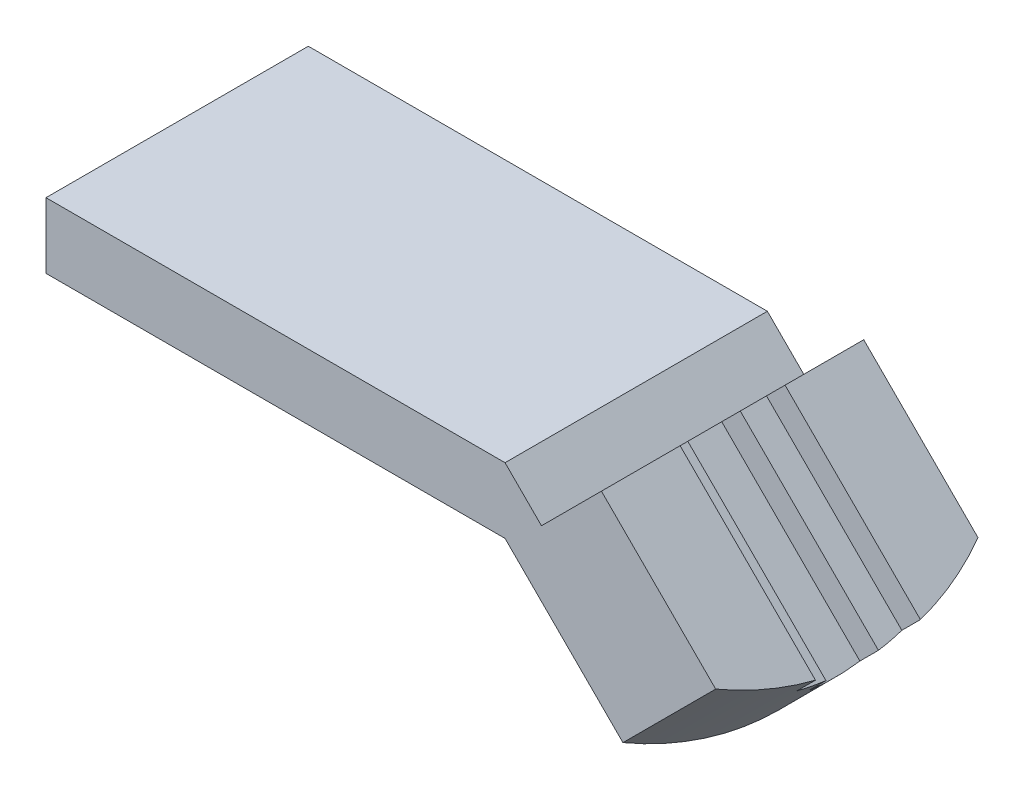
ISO-10303-21;
HEADER;
FILE_DESCRIPTION(('STEP AP214'),'2;1');
FILE_NAME('part.step','',(''),(''),'','','');
FILE_SCHEMA(('AUTOMOTIVE_DESIGN { 1 0 10303 214 1 1 1 1 }'));
ENDSEC;
DATA;
#1=APPLICATION_CONTEXT('core data for automotive mechanical design processes');
#2=APPLICATION_PROTOCOL_DEFINITION('international standard','automotive_design',2000,#1);
#3=PRODUCT_CONTEXT('',#1,'mechanical');
#4=PRODUCT('Part','Part','',(#3));
#5=PRODUCT_RELATED_PRODUCT_CATEGORY('part','',(#4));
#6=PRODUCT_DEFINITION_FORMATION('','',#4);
#7=PRODUCT_DEFINITION_CONTEXT('part definition',#1,'design');
#8=PRODUCT_DEFINITION('design','',#6,#7);
#9=PRODUCT_DEFINITION_SHAPE('','',#8);
#10=(LENGTH_UNIT() NAMED_UNIT(*) SI_UNIT(.MILLI.,.METRE.));
#11=(NAMED_UNIT(*) PLANE_ANGLE_UNIT() SI_UNIT($,.RADIAN.));
#12=(NAMED_UNIT(*) SI_UNIT($,.STERADIAN.) SOLID_ANGLE_UNIT());
#13=UNCERTAINTY_MEASURE_WITH_UNIT(LENGTH_MEASURE(1.E-05),#10,'distance_accuracy_value','');
#14=(GEOMETRIC_REPRESENTATION_CONTEXT(3) GLOBAL_UNCERTAINTY_ASSIGNED_CONTEXT((#13)) GLOBAL_UNIT_ASSIGNED_CONTEXT((#10,
#11,#12)) REPRESENTATION_CONTEXT('',''));
#15=CARTESIAN_POINT('',(0.,0.,0.));
#16=DIRECTION('',(0.,0.,1.));
#17=DIRECTION('',(1.,0.,0.));
#18=AXIS2_PLACEMENT_3D('',#15,#16,#17);
#19=CARTESIAN_POINT('',(52.9540920986001,-3.81195647486901,20.));
#20=DIRECTION('',(-0.70710678118654,-0.707106781186555,0.));
#21=DIRECTION('',(0.707106781186555,-0.70710678118654,0.));
#22=AXIS2_PLACEMENT_3D('',#19,#20,#21);
#23=PLANE('',#22);
#24=DIRECTION('',(-0.707106781186551,0.707106781186544,0.));
#25=VECTOR('',#24,1.);
#26=CARTESIAN_POINT('',(140.848249718156,-91.7061140944243,6.));
#27=LINE('',#26,#25);
#28=CARTESIAN_POINT('',(52.6683629354202,-3.52622731168906,5.99999999999998));
#29=VERTEX_POINT('',#28);
#30=CARTESIAN_POINT('',(42.3474903808018,6.79464524292908,6.));
#31=VERTEX_POINT('',#30);
#32=EDGE_CURVE('E168',#29,#31,#27,.T.);
#33=ORIENTED_EDGE('',*,*,#32,.F.);
#34=CARTESIAN_POINT('',(38.811956474869,10.3301791488618,10.));
#35=DIRECTION('',(-0.70710678118654,-0.707106781186555,0.));
#36=DIRECTION('',(0.707106781186555,-0.70710678118654,0.));
#37=AXIS2_PLACEMENT_3D('',#34,#35,#36);
#38=CIRCLE('',#37,20.);
#39=CARTESIAN_POINT('',(51.059405188785,-1.91726956505396,0.));
#40=VERTEX_POINT('',#39);
#41=EDGE_CURVE('E184',#29,#40,#38,.F.);
#42=ORIENTED_EDGE('',*,*,#41,.T.);
#43=DIRECTION('',(-0.707106781186555,0.70710678118654,0.));
#44=VECTOR('',#43,1.);
#45=CARTESIAN_POINT('',(52.9540920986001,-3.81195647486901,0.));
#46=LINE('',#45,#44);
#47=CARTESIAN_POINT('',(42.3474903808018,6.79464524292908,0.));
#48=VERTEX_POINT('',#47);
#49=EDGE_CURVE('E264',#40,#48,#46,.T.);
#50=ORIENTED_EDGE('',*,*,#49,.T.);
#51=DIRECTION('',(0.,0.,-1.));
#52=VECTOR('',#51,1.);
#53=CARTESIAN_POINT('',(42.3474903808018,6.79464524292908,20.));
#54=LINE('',#53,#52);
#55=EDGE_CURVE('E286',#31,#48,#54,.T.);
#56=ORIENTED_EDGE('',*,*,#55,.F.);
#57=EDGE_LOOP('',(#33,#42,#50,#56));
#58=FACE_BOUND('',#57,.T.);
#59=ADVANCED_FACE('F43',(#58),#23,.F.);
#60=CARTESIAN_POINT('',(35.,0.,20.));
#61=DIRECTION('',(0.707106781186544,0.707106781186551,0.));
#62=DIRECTION('',(-0.707106781186551,0.707106781186544,0.));
#63=AXIS2_PLACEMENT_3D('',#60,#61,#62);
#64=PLANE('',#63);
#65=DIRECTION('',(0.707106781186551,-0.707106781186544,0.));
#66=VECTOR('',#65,1.);
#67=CARTESIAN_POINT('',(35.,0.,0.));
#68=LINE('',#67,#66);
#69=CARTESIAN_POINT('',(35.,0.,0.));
#70=VERTEX_POINT('',#69);
#71=CARTESIAN_POINT('',(43.9883373769196,-8.9883373769195,0.));
#72=VERTEX_POINT('',#71);
#73=EDGE_CURVE('E261',#70,#72,#68,.T.);
#74=ORIENTED_EDGE('',*,*,#73,.T.);
#75=CARTESIAN_POINT('',(31.7408886630036,3.25911133699631,10.));
#76=DIRECTION('',(0.707106781186544,0.707106781186551,0.));
#77=DIRECTION('',(-0.707106781186551,0.707106781186544,0.));
#78=AXIS2_PLACEMENT_3D('',#75,#76,#77);
#79=CIRCLE('',#78,20.);
#80=CARTESIAN_POINT('',(43.9883373769196,-8.9883373769195,20.));
#81=VERTEX_POINT('',#80);
#82=EDGE_CURVE('E67',#72,#81,#79,.F.);
#83=ORIENTED_EDGE('',*,*,#82,.T.);
#84=DIRECTION('',(0.707106781186551,-0.707106781186544,0.));
#85=VECTOR('',#84,1.);
#86=CARTESIAN_POINT('',(35.,0.,20.));
#87=LINE('',#86,#85);
#88=CARTESIAN_POINT('',(35.,0.,20.));
#89=VERTEX_POINT('',#88);
#90=EDGE_CURVE('E239',#89,#81,#87,.T.);
#91=ORIENTED_EDGE('',*,*,#90,.F.);
#92=DIRECTION('',(0.,0.,-1.));
#93=VECTOR('',#92,1.);
#94=CARTESIAN_POINT('',(35.,0.,20.));
#95=LINE('',#94,#93);
#96=EDGE_CURVE('E291',#89,#70,#95,.T.);
#97=ORIENTED_EDGE('',*,*,#96,.T.);
#98=EDGE_LOOP('',(#74,#83,#91,#97));
#99=FACE_BOUND('',#98,.T.);
#100=ADVANCED_FACE('F372',(#99),#64,.F.);
#101=DIRECTION('',(-0.707106781186555,0.70710678118654,0.));
#102=VECTOR('',#101,1.);
#103=CARTESIAN_POINT('',(52.9540920986001,-3.81195647486901,20.));
#104=LINE('',#103,#102);
#105=CARTESIAN_POINT('',(51.059405188785,-1.91726956505396,20.));
#106=VERTEX_POINT('',#105);
#107=CARTESIAN_POINT('',(42.3474903808018,6.79464524292908,20.));
#108=VERTEX_POINT('',#107);
#109=EDGE_CURVE('E242',#106,#108,#104,.T.);
#110=ORIENTED_EDGE('',*,*,#109,.F.);
#111=CARTESIAN_POINT('',(38.811956474869,10.3301791488618,10.));
#112=DIRECTION('',(-0.70710678118654,-0.707106781186555,0.));
#113=DIRECTION('',(0.707106781186555,-0.70710678118654,0.));
#114=AXIS2_PLACEMENT_3D('',#111,#112,#113);
#115=CIRCLE('',#114,20.);
#116=CARTESIAN_POINT('',(52.6683629354201,-3.52622731168906,14.));
#117=VERTEX_POINT('',#116);
#118=EDGE_CURVE('E200',#106,#117,#115,.F.);
#119=ORIENTED_EDGE('',*,*,#118,.T.);
#120=DIRECTION('',(-0.707106781186551,0.707106781186544,0.));
#121=VECTOR('',#120,1.);
#122=CARTESIAN_POINT('',(140.848249718156,-91.7061140944243,14.));
#123=LINE('',#122,#121);
#124=CARTESIAN_POINT('',(42.3474903808018,6.79464524292908,14.));
#125=VERTEX_POINT('',#124);
#126=EDGE_CURVE('E227',#117,#125,#123,.T.);
#127=ORIENTED_EDGE('',*,*,#126,.T.);
#128=EDGE_CURVE('E287',#108,#125,#54,.T.);
#129=ORIENTED_EDGE('',*,*,#128,.F.);
#130=EDGE_LOOP('',(#110,#119,#127,#129));
#131=FACE_BOUND('',#130,.T.);
#132=ADVANCED_FACE('F365',(#131),#23,.F.);
#133=CARTESIAN_POINT('',(0.,0.,20.));
#134=DIRECTION('',(0.,0.,-1.));
#135=DIRECTION('',(-1.,0.,0.));
#136=AXIS2_PLACEMENT_3D('',#133,#134,#135);
#137=PLANE('',#136);
#138=DIRECTION('',(-0.70710678118654,-0.707106781186555,0.));
#139=VECTOR('',#138,1.);
#140=CARTESIAN_POINT('',(103.474782449922,50.498107696084,20.));
#141=LINE('',#140,#139);
#142=EDGE_CURVE('E59',#106,#81,#141,.T.);
#143=ORIENTED_EDGE('',*,*,#142,.F.);
#144=ORIENTED_EDGE('',*,*,#109,.T.);
#145=DIRECTION('',(-0.707106781186544,-0.707106781186552,0.));
#146=VECTOR('',#145,1.);
#147=CARTESIAN_POINT('',(42.3474903808018,6.79464524292908,20.));
#148=LINE('',#147,#146);
#149=CARTESIAN_POINT('',(37.7764225689363,2.22357743106358,20.));
#150=VERTEX_POINT('',#149);
#151=EDGE_CURVE('E245',#108,#150,#148,.T.);
#152=ORIENTED_EDGE('',*,*,#151,.T.);
#153=DIRECTION('',(-0.707106781186536,0.707106781186559,0.));
#154=VECTOR('',#153,1.);
#155=CARTESIAN_POINT('',(37.7764225689363,2.22357743106358,20.));
#156=LINE('',#155,#154);
#157=CARTESIAN_POINT('',(35.,5.,20.));
#158=VERTEX_POINT('',#157);
#159=EDGE_CURVE('E248',#150,#158,#156,.T.);
#160=ORIENTED_EDGE('',*,*,#159,.T.);
#161=DIRECTION('',(-1.,0.,0.));
#162=VECTOR('',#161,1.);
#163=CARTESIAN_POINT('',(0.,5.,20.));
#164=LINE('',#163,#162);
#165=CARTESIAN_POINT('',(0.,5.,20.));
#166=VERTEX_POINT('',#165);
#167=EDGE_CURVE('E251',#158,#166,#164,.T.);
#168=ORIENTED_EDGE('',*,*,#167,.T.);
#169=DIRECTION('',(0.,-1.,0.));
#170=VECTOR('',#169,1.);
#171=CARTESIAN_POINT('',(0.,0.,20.));
#172=LINE('',#171,#170);
#173=CARTESIAN_POINT('',(0.,0.,20.));
#174=VERTEX_POINT('',#173);
#175=EDGE_CURVE('E231',#166,#174,#172,.T.);
#176=ORIENTED_EDGE('',*,*,#175,.T.);
#177=DIRECTION('',(1.,0.,0.));
#178=VECTOR('',#177,1.);
#179=CARTESIAN_POINT('',(0.,0.,20.));
#180=LINE('',#179,#178);
#181=EDGE_CURVE('E235',#174,#89,#180,.T.);
#182=ORIENTED_EDGE('',*,*,#181,.T.);
#183=ORIENTED_EDGE('',*,*,#90,.T.);
#184=EDGE_LOOP('',(#143,#144,#152,#160,#168,#176,#182,#183));
#185=FACE_BOUND('',#184,.T.);
#186=ADVANCED_FACE('F361',(#185),#137,.F.);
#187=CARTESIAN_POINT('',(0.,0.,0.));
#188=DIRECTION('',(0.,0.,-1.));
#189=DIRECTION('',(-1.,0.,0.));
#190=AXIS2_PLACEMENT_3D('',#187,#188,#189);
#191=PLANE('',#190);
#192=ORIENTED_EDGE('',*,*,#49,.F.);
#193=DIRECTION('',(-0.70710678118654,-0.707106781186555,0.));
#194=VECTOR('',#193,1.);
#195=CARTESIAN_POINT('',(103.474782449922,50.498107696084,0.));
#196=LINE('',#195,#194);
#197=EDGE_CURVE('E179',#40,#72,#196,.T.);
#198=ORIENTED_EDGE('',*,*,#197,.T.);
#199=ORIENTED_EDGE('',*,*,#73,.F.);
#200=DIRECTION('',(1.,0.,0.));
#201=VECTOR('',#200,1.);
#202=CARTESIAN_POINT('',(0.,0.,0.));
#203=LINE('',#202,#201);
#204=CARTESIAN_POINT('',(0.,0.,0.));
#205=VERTEX_POINT('',#204);
#206=EDGE_CURVE('E258',#205,#70,#203,.T.);
#207=ORIENTED_EDGE('',*,*,#206,.F.);
#208=DIRECTION('',(0.,-1.,0.));
#209=VECTOR('',#208,1.);
#210=CARTESIAN_POINT('',(0.,0.,0.));
#211=LINE('',#210,#209);
#212=CARTESIAN_POINT('',(0.,5.,0.));
#213=VERTEX_POINT('',#212);
#214=EDGE_CURVE('E230',#213,#205,#211,.T.);
#215=ORIENTED_EDGE('',*,*,#214,.F.);
#216=DIRECTION('',(-1.,0.,0.));
#217=VECTOR('',#216,1.);
#218=CARTESIAN_POINT('',(0.,5.,0.));
#219=LINE('',#218,#217);
#220=CARTESIAN_POINT('',(35.,5.,0.));
#221=VERTEX_POINT('',#220);
#222=EDGE_CURVE('E236',#221,#213,#219,.T.);
#223=ORIENTED_EDGE('',*,*,#222,.F.);
#224=DIRECTION('',(-0.707106781186536,0.707106781186559,0.));
#225=VECTOR('',#224,1.);
#226=CARTESIAN_POINT('',(37.7764225689363,2.22357743106358,0.));
#227=LINE('',#226,#225);
#228=CARTESIAN_POINT('',(37.7764225689363,2.22357743106358,0.));
#229=VERTEX_POINT('',#228);
#230=EDGE_CURVE('E270',#229,#221,#227,.T.);
#231=ORIENTED_EDGE('',*,*,#230,.F.);
#232=DIRECTION('',(-0.707106781186544,-0.707106781186552,0.));
#233=VECTOR('',#232,1.);
#234=CARTESIAN_POINT('',(42.3474903808018,6.79464524292908,0.));
#235=LINE('',#234,#233);
#236=EDGE_CURVE('E267',#48,#229,#235,.T.);
#237=ORIENTED_EDGE('',*,*,#236,.F.);
#238=EDGE_LOOP('',(#192,#198,#199,#207,#215,#223,#231,#237));
#239=FACE_BOUND('',#238,.T.);
#240=ADVANCED_FACE('F351',(#239),#191,.T.);
#241=CARTESIAN_POINT('',(139.434036155783,-93.1203276567974,14.));
#242=DIRECTION('',(0.707106781186544,0.707106781186551,0.));
#243=DIRECTION('',(-0.707106781186551,0.707106781186544,0.));
#244=AXIS2_PLACEMENT_3D('',#241,#242,#243);
#245=PLANE('',#244);
#246=CARTESIAN_POINT('',(37.397742912496,8.91596558648877,10.));
#247=DIRECTION('',(0.707106781186544,0.707106781186551,0.));
#248=DIRECTION('',(-0.707106781186551,0.707106781186544,0.));
#249=AXIS2_PLACEMENT_3D('',#246,#247,#248);
#250=CIRCLE('',#249,20.);
#251=CARTESIAN_POINT('',(51.4689901919663,-5.15528169298147,12.));
#252=VERTEX_POINT('',#251);
#253=CARTESIAN_POINT('',(51.2541493730471,-4.94044087406217,14.));
#254=VERTEX_POINT('',#253);
#255=EDGE_CURVE('E194',#252,#254,#250,.F.);
#256=ORIENTED_EDGE('',*,*,#255,.F.);
#257=DIRECTION('',(-0.707106781186551,0.707106781186544,0.));
#258=VECTOR('',#257,1.);
#259=CARTESIAN_POINT('',(139.434036155783,-93.1203276567974,12.));
#260=LINE('',#259,#258);
#261=CARTESIAN_POINT('',(40.9332768184287,5.38043168055604,12.));
#262=VERTEX_POINT('',#261);
#263=EDGE_CURVE('E221',#252,#262,#260,.T.);
#264=ORIENTED_EDGE('',*,*,#263,.T.);
#265=DIRECTION('',(0.,0.,1.));
#266=VECTOR('',#265,1.);
#267=CARTESIAN_POINT('',(40.9332768184287,5.38043168055604,20.));
#268=LINE('',#267,#266);
#269=CARTESIAN_POINT('',(40.9332768184287,5.38043168055604,14.));
#270=VERTEX_POINT('',#269);
#271=EDGE_CURVE('E316',#262,#270,#268,.T.);
#272=ORIENTED_EDGE('',*,*,#271,.T.);
#273=DIRECTION('',(-0.707106781186551,0.707106781186544,0.));
#274=VECTOR('',#273,1.);
#275=CARTESIAN_POINT('',(139.434036155783,-93.1203276567974,14.));
#276=LINE('',#275,#274);
#277=EDGE_CURVE('E224',#254,#270,#276,.T.);
#278=ORIENTED_EDGE('',*,*,#277,.F.);
#279=EDGE_LOOP('',(#256,#264,#272,#278));
#280=FACE_BOUND('',#279,.T.);
#281=ADVANCED_FACE('F333',(#280),#245,.T.);
#282=CARTESIAN_POINT('',(138.01982259341,-94.5345412191705,12.));
#283=DIRECTION('',(0.707106781186544,0.707106781186551,0.));
#284=DIRECTION('',(-0.707106781186551,0.707106781186544,0.));
#285=AXIS2_PLACEMENT_3D('',#282,#283,#284);
#286=PLANE('',#285);
#287=CARTESIAN_POINT('',(35.9835293501229,7.50175202411565,10.));
#288=DIRECTION('',(0.707106781186544,0.707106781186551,0.));
#289=DIRECTION('',(-0.707106781186551,0.707106781186544,0.));
#290=AXIS2_PLACEMENT_3D('',#287,#288,#289);
#291=CIRCLE('',#290,20.);
#292=CARTESIAN_POINT('',(50.0547766295933,-6.56949525535458,8.));
#293=VERTEX_POINT('',#292);
#294=CARTESIAN_POINT('',(50.0547766295932,-6.56949525535455,12.));
#295=VERTEX_POINT('',#294);
#296=EDGE_CURVE('E189',#293,#295,#291,.F.);
#297=ORIENTED_EDGE('',*,*,#296,.F.);
#298=DIRECTION('',(-0.707106781186551,0.707106781186544,0.));
#299=VECTOR('',#298,1.);
#300=CARTESIAN_POINT('',(138.01982259341,-94.5345412191705,8.));
#301=LINE('',#300,#299);
#302=CARTESIAN_POINT('',(39.5190632560557,3.96621811818294,8.));
#303=VERTEX_POINT('',#302);
#304=EDGE_CURVE('E215',#293,#303,#301,.T.);
#305=ORIENTED_EDGE('',*,*,#304,.T.);
#306=DIRECTION('',(0.,0.,1.));
#307=VECTOR('',#306,1.);
#308=CARTESIAN_POINT('',(39.5190632560557,3.96621811818293,20.));
#309=LINE('',#308,#307);
#310=CARTESIAN_POINT('',(39.5190632560557,3.96621811818293,12.));
#311=VERTEX_POINT('',#310);
#312=EDGE_CURVE('E308',#303,#311,#309,.T.);
#313=ORIENTED_EDGE('',*,*,#312,.T.);
#314=DIRECTION('',(-0.707106781186551,0.707106781186544,0.));
#315=VECTOR('',#314,1.);
#316=CARTESIAN_POINT('',(138.01982259341,-94.5345412191705,12.));
#317=LINE('',#316,#315);
#318=EDGE_CURVE('E218',#295,#311,#317,.T.);
#319=ORIENTED_EDGE('',*,*,#318,.F.);
#320=EDGE_LOOP('',(#297,#305,#313,#319));
#321=FACE_BOUND('',#320,.T.);
#322=ADVANCED_FACE('F341',(#321),#286,.T.);
#323=CARTESIAN_POINT('',(139.434036155783,-93.1203276567974,8.));
#324=DIRECTION('',(0.707106781186544,0.707106781186551,0.));
#325=DIRECTION('',(-0.707106781186551,0.707106781186544,0.));
#326=AXIS2_PLACEMENT_3D('',#323,#324,#325);
#327=PLANE('',#326);
#328=CARTESIAN_POINT('',(37.397742912496,8.91596558648877,10.));
#329=DIRECTION('',(0.707106781186544,0.707106781186551,0.));
#330=DIRECTION('',(-0.707106781186551,0.707106781186544,0.));
#331=AXIS2_PLACEMENT_3D('',#328,#329,#330);
#332=CIRCLE('',#331,20.);
#333=CARTESIAN_POINT('',(51.2541493730471,-4.94044087406219,5.99999999999998));
#334=VERTEX_POINT('',#333);
#335=CARTESIAN_POINT('',(51.4689901919663,-5.15528169298144,8.));
#336=VERTEX_POINT('',#335);
#337=EDGE_CURVE('E172',#334,#336,#332,.F.);
#338=ORIENTED_EDGE('',*,*,#337,.F.);
#339=DIRECTION('',(-0.707106781186551,0.707106781186544,0.));
#340=VECTOR('',#339,1.);
#341=CARTESIAN_POINT('',(139.434036155783,-93.1203276567974,6.));
#342=LINE('',#341,#340);
#343=CARTESIAN_POINT('',(40.9332768184287,5.38043168055604,6.));
#344=VERTEX_POINT('',#343);
#345=EDGE_CURVE('E158',#334,#344,#342,.T.);
#346=ORIENTED_EDGE('',*,*,#345,.T.);
#347=DIRECTION('',(0.,0.,1.));
#348=VECTOR('',#347,1.);
#349=CARTESIAN_POINT('',(40.9332768184287,5.38043168055604,20.));
#350=LINE('',#349,#348);
#351=CARTESIAN_POINT('',(40.9332768184287,5.38043168055604,8.));
#352=VERTEX_POINT('',#351);
#353=EDGE_CURVE('E301',#344,#352,#350,.T.);
#354=ORIENTED_EDGE('',*,*,#353,.T.);
#355=DIRECTION('',(-0.707106781186551,0.707106781186544,0.));
#356=VECTOR('',#355,1.);
#357=CARTESIAN_POINT('',(139.434036155783,-93.1203276567974,8.));
#358=LINE('',#357,#356);
#359=EDGE_CURVE('E174',#336,#352,#358,.T.);
#360=ORIENTED_EDGE('',*,*,#359,.F.);
#361=EDGE_LOOP('',(#338,#346,#354,#360));
#362=FACE_BOUND('',#361,.T.);
#363=ADVANCED_FACE('F173',(#362),#327,.T.);
#364=CARTESIAN_POINT('',(42.3474903808018,6.79464524292908,20.));
#365=DIRECTION('',(0.707106781186552,-0.707106781186544,0.));
#366=DIRECTION('',(0.707106781186544,0.707106781186551,0.));
#367=AXIS2_PLACEMENT_3D('',#364,#365,#366);
#368=PLANE('',#367);
#369=DIRECTION('',(0.707106781186544,0.707106781186551,0.));
#370=VECTOR('',#369,1.);
#371=CARTESIAN_POINT('',(42.3474903808018,6.79464524292908,14.));
#372=LINE('',#371,#370);
#373=EDGE_CURVE('E52',#270,#125,#372,.T.);
#374=ORIENTED_EDGE('',*,*,#373,.F.);
#375=ORIENTED_EDGE('',*,*,#271,.F.);
#376=DIRECTION('',(0.707106781186544,0.707106781186551,0.));
#377=VECTOR('',#376,1.);
#378=CARTESIAN_POINT('',(42.3474903808018,6.79464524292908,12.));
#379=LINE('',#378,#377);
#380=EDGE_CURVE('E312',#311,#262,#379,.T.);
#381=ORIENTED_EDGE('',*,*,#380,.F.);
#382=ORIENTED_EDGE('',*,*,#312,.F.);
#383=DIRECTION('',(-0.707106781186544,-0.707106781186551,0.));
#384=VECTOR('',#383,1.);
#385=CARTESIAN_POINT('',(42.3474903808018,6.79464524292908,8.));
#386=LINE('',#385,#384);
#387=EDGE_CURVE('E304',#352,#303,#386,.T.);
#388=ORIENTED_EDGE('',*,*,#387,.F.);
#389=ORIENTED_EDGE('',*,*,#353,.F.);
#390=DIRECTION('',(-0.707106781186544,-0.707106781186551,0.));
#391=VECTOR('',#390,1.);
#392=CARTESIAN_POINT('',(42.3474903808018,6.79464524292907,6.));
#393=LINE('',#392,#391);
#394=EDGE_CURVE('E163',#31,#344,#393,.T.);
#395=ORIENTED_EDGE('',*,*,#394,.F.);
#396=ORIENTED_EDGE('',*,*,#55,.T.);
#397=ORIENTED_EDGE('',*,*,#236,.T.);
#398=DIRECTION('',(0.,0.,-1.));
#399=VECTOR('',#398,1.);
#400=CARTESIAN_POINT('',(37.7764225689363,2.22357743106358,20.));
#401=LINE('',#400,#399);
#402=EDGE_CURVE('E282',#150,#229,#401,.T.);
#403=ORIENTED_EDGE('',*,*,#402,.F.);
#404=ORIENTED_EDGE('',*,*,#151,.F.);
#405=ORIENTED_EDGE('',*,*,#128,.T.);
#406=EDGE_LOOP('',(#374,#375,#381,#382,#388,#389,#395,#396,#397,#403,#404,#405));
#407=FACE_BOUND('',#406,.T.);
#408=ADVANCED_FACE('F328',(#407),#368,.F.);
#409=CARTESIAN_POINT('',(0.,0.,20.));
#410=DIRECTION('',(1.,0.,0.));
#411=DIRECTION('',(0.,0.,-1.));
#412=AXIS2_PLACEMENT_3D('',#409,#410,#411);
#413=PLANE('',#412);
#414=ORIENTED_EDGE('',*,*,#214,.T.);
#415=DIRECTION('',(0.,0.,-1.));
#416=VECTOR('',#415,1.);
#417=CARTESIAN_POINT('',(0.,0.,20.));
#418=LINE('',#417,#416);
#419=EDGE_CURVE('E295',#174,#205,#418,.T.);
#420=ORIENTED_EDGE('',*,*,#419,.F.);
#421=ORIENTED_EDGE('',*,*,#175,.F.);
#422=DIRECTION('',(0.,0.,-1.));
#423=VECTOR('',#422,1.);
#424=CARTESIAN_POINT('',(0.,5.,20.));
#425=LINE('',#424,#423);
#426=EDGE_CURVE('E254',#166,#213,#425,.T.);
#427=ORIENTED_EDGE('',*,*,#426,.T.);
#428=EDGE_LOOP('',(#414,#420,#421,#427));
#429=FACE_BOUND('',#428,.T.);
#430=ADVANCED_FACE('F45',(#429),#413,.F.);
#431=CARTESIAN_POINT('',(0.,0.,20.));
#432=DIRECTION('',(0.,1.,0.));
#433=DIRECTION('',(0.,0.,1.));
#434=AXIS2_PLACEMENT_3D('',#431,#432,#433);
#435=PLANE('',#434);
#436=ORIENTED_EDGE('',*,*,#206,.T.);
#437=ORIENTED_EDGE('',*,*,#96,.F.);
#438=ORIENTED_EDGE('',*,*,#181,.F.);
#439=ORIENTED_EDGE('',*,*,#419,.T.);
#440=EDGE_LOOP('',(#436,#437,#438,#439));
#441=FACE_BOUND('',#440,.T.);
#442=ADVANCED_FACE('F496',(#441),#435,.F.);
#443=CARTESIAN_POINT('',(37.7764225689363,2.22357743106358,20.));
#444=DIRECTION('',(-0.707106781186559,-0.707106781186536,0.));
#445=DIRECTION('',(0.707106781186536,-0.707106781186559,0.));
#446=AXIS2_PLACEMENT_3D('',#443,#444,#445);
#447=PLANE('',#446);
#448=ORIENTED_EDGE('',*,*,#230,.T.);
#449=DIRECTION('',(0.,0.,-1.));
#450=VECTOR('',#449,1.);
#451=CARTESIAN_POINT('',(35.,5.,20.));
#452=LINE('',#451,#450);
#453=EDGE_CURVE('E278',#158,#221,#452,.T.);
#454=ORIENTED_EDGE('',*,*,#453,.F.);
#455=ORIENTED_EDGE('',*,*,#159,.F.);
#456=ORIENTED_EDGE('',*,*,#402,.T.);
#457=EDGE_LOOP('',(#448,#454,#455,#456));
#458=FACE_BOUND('',#457,.T.);
#459=ADVANCED_FACE('F358',(#458),#447,.F.);
#460=CARTESIAN_POINT('',(0.,5.,20.));
#461=DIRECTION('',(0.,-1.,0.));
#462=DIRECTION('',(0.,0.,-1.));
#463=AXIS2_PLACEMENT_3D('',#460,#461,#462);
#464=PLANE('',#463);
#465=ORIENTED_EDGE('',*,*,#222,.T.);
#466=ORIENTED_EDGE('',*,*,#426,.F.);
#467=ORIENTED_EDGE('',*,*,#167,.F.);
#468=ORIENTED_EDGE('',*,*,#453,.T.);
#469=EDGE_LOOP('',(#465,#466,#467,#468));
#470=FACE_BOUND('',#469,.T.);
#471=ADVANCED_FACE('F444',(#470),#464,.F.);
#472=CARTESIAN_POINT('',(140.848249718156,-91.7061140944243,14.));
#473=DIRECTION('',(0.,0.,-1.));
#474=DIRECTION('',(0.,1.,0.));
#475=AXIS2_PLACEMENT_3D('',#472,#473,#474);
#476=PLANE('',#475);
#477=DIRECTION('',(-0.70710678118654,-0.707106781186555,0.));
#478=VECTOR('',#477,1.);
#479=CARTESIAN_POINT('',(105.083740196557,48.8891499494489,14.0000000000001));
#480=LINE('',#479,#478);
#481=EDGE_CURVE('E205',#254,#117,#480,.F.);
#482=ORIENTED_EDGE('',*,*,#481,.F.);
#483=ORIENTED_EDGE('',*,*,#277,.T.);
#484=ORIENTED_EDGE('',*,*,#373,.T.);
#485=ORIENTED_EDGE('',*,*,#126,.F.);
#486=EDGE_LOOP('',(#482,#483,#484,#485));
#487=FACE_BOUND('',#486,.T.);
#488=ADVANCED_FACE('F324',(#487),#476,.T.);
#489=CARTESIAN_POINT('',(139.434036155783,-93.1203276567974,12.));
#490=DIRECTION('',(0.,0.,-1.));
#491=DIRECTION('',(-1.,0.,0.));
#492=AXIS2_PLACEMENT_3D('',#489,#490,#491);
#493=PLANE('',#492);
#494=DIRECTION('',(-0.70710678118654,-0.707106781186555,0.));
#495=VECTOR('',#494,1.);
#496=CARTESIAN_POINT('',(105.298581015476,48.6743091305296,12.));
#497=LINE('',#496,#495);
#498=EDGE_CURVE('E188',#295,#252,#497,.F.);
#499=ORIENTED_EDGE('',*,*,#498,.F.);
#500=ORIENTED_EDGE('',*,*,#318,.T.);
#501=ORIENTED_EDGE('',*,*,#380,.T.);
#502=ORIENTED_EDGE('',*,*,#263,.F.);
#503=EDGE_LOOP('',(#499,#500,#501,#502));
#504=FACE_BOUND('',#503,.T.);
#505=ADVANCED_FACE('F337',(#504),#493,.T.);
#506=CARTESIAN_POINT('',(138.01982259341,-94.5345412191705,8.));
#507=DIRECTION('',(0.,0.,1.));
#508=DIRECTION('',(1.,0.,0.));
#509=AXIS2_PLACEMENT_3D('',#506,#507,#508);
#510=PLANE('',#509);
#511=DIRECTION('',(-0.70710678118654,-0.707106781186555,0.));
#512=VECTOR('',#511,1.);
#513=CARTESIAN_POINT('',(105.298581015476,48.6743091305296,8.));
#514=LINE('',#513,#512);
#515=EDGE_CURVE('E178',#336,#293,#514,.T.);
#516=ORIENTED_EDGE('',*,*,#515,.F.);
#517=ORIENTED_EDGE('',*,*,#359,.T.);
#518=ORIENTED_EDGE('',*,*,#387,.T.);
#519=ORIENTED_EDGE('',*,*,#304,.F.);
#520=EDGE_LOOP('',(#516,#517,#518,#519));
#521=FACE_BOUND('',#520,.T.);
#522=ADVANCED_FACE('F344',(#521),#510,.T.);
#523=CARTESIAN_POINT('',(139.434036155783,-93.1203276567974,6.));
#524=DIRECTION('',(0.,0.,1.));
#525=DIRECTION('',(0.,-1.,0.));
#526=AXIS2_PLACEMENT_3D('',#523,#524,#525);
#527=PLANE('',#526);
#528=DIRECTION('',(-0.70710678118654,-0.707106781186555,0.));
#529=VECTOR('',#528,1.);
#530=CARTESIAN_POINT('',(105.083740196557,48.8891499494489,5.99999999999997));
#531=LINE('',#530,#529);
#532=EDGE_CURVE('E11',#29,#334,#531,.T.);
#533=ORIENTED_EDGE('',*,*,#532,.F.);
#534=ORIENTED_EDGE('',*,*,#32,.T.);
#535=ORIENTED_EDGE('',*,*,#394,.T.);
#536=ORIENTED_EDGE('',*,*,#345,.F.);
#537=EDGE_LOOP('',(#533,#534,#535,#536));
#538=FACE_BOUND('',#537,.T.);
#539=ADVANCED_FACE('F160',(#538),#527,.T.);
#540=CARTESIAN_POINT('',(91.2273337360058,62.7455564099998,10.));
#541=DIRECTION('',(-0.70710678118654,-0.707106781186555,0.));
#542=DIRECTION('',(0.707106781186555,-0.70710678118654,0.));
#543=AXIS2_PLACEMENT_3D('',#540,#541,#542);
#544=CYLINDRICAL_SURFACE('',#543,20.);
#545=ORIENTED_EDGE('',*,*,#82,.F.);
#546=ORIENTED_EDGE('',*,*,#197,.F.);
#547=ORIENTED_EDGE('',*,*,#41,.F.);
#548=ORIENTED_EDGE('',*,*,#532,.T.);
#549=ORIENTED_EDGE('',*,*,#337,.T.);
#550=ORIENTED_EDGE('',*,*,#515,.T.);
#551=ORIENTED_EDGE('',*,*,#296,.T.);
#552=ORIENTED_EDGE('',*,*,#498,.T.);
#553=ORIENTED_EDGE('',*,*,#255,.T.);
#554=ORIENTED_EDGE('',*,*,#481,.T.);
#555=ORIENTED_EDGE('',*,*,#118,.F.);
#556=ORIENTED_EDGE('',*,*,#142,.T.);
#557=EDGE_LOOP('',(#545,#546,#547,#548,#549,#550,#551,#552,#553,#554,#555,#556));
#558=FACE_BOUND('',#557,.T.);
#559=ADVANCED_FACE('F182',(#558),#544,.T.);
#560=CLOSED_SHELL('',(#59,#100,#132,#186,#240,#281,#322,#363,#408,#430,#442,#459,#471,#488,#505,
#522,#539,#559));
#561=MANIFOLD_SOLID_BREP('B2',#560);
#562=ADVANCED_BREP_SHAPE_REPRESENTATION('',(#18,#561),#14);
#563=SHAPE_DEFINITION_REPRESENTATION(#9,#562);
ENDSEC;
END-ISO-10303-21;
